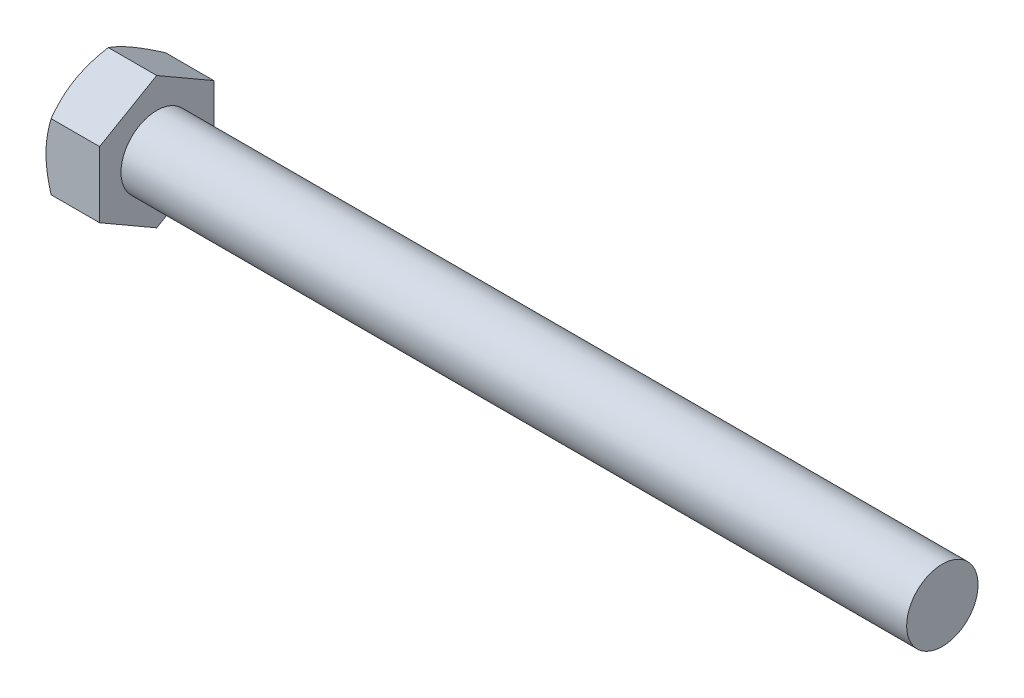
ISO-10303-21;
HEADER;
FILE_DESCRIPTION(('STEP AP214'),'2;1');
FILE_NAME('part.step','',(''),(''),'','','');
FILE_SCHEMA(('AUTOMOTIVE_DESIGN { 1 0 10303 214 1 1 1 1 }'));
ENDSEC;
DATA;
#1=APPLICATION_CONTEXT('core data for automotive mechanical design processes');
#2=APPLICATION_PROTOCOL_DEFINITION('international standard','automotive_design',2000,#1);
#3=PRODUCT_CONTEXT('',#1,'mechanical');
#4=PRODUCT('Part','Part','',(#3));
#5=PRODUCT_RELATED_PRODUCT_CATEGORY('part','',(#4));
#6=PRODUCT_DEFINITION_FORMATION('','',#4);
#7=PRODUCT_DEFINITION_CONTEXT('part definition',#1,'design');
#8=PRODUCT_DEFINITION('design','',#6,#7);
#9=PRODUCT_DEFINITION_SHAPE('','',#8);
#10=(LENGTH_UNIT() NAMED_UNIT(*) SI_UNIT(.MILLI.,.METRE.));
#11=(NAMED_UNIT(*) PLANE_ANGLE_UNIT() SI_UNIT($,.RADIAN.));
#12=(NAMED_UNIT(*) SI_UNIT($,.STERADIAN.) SOLID_ANGLE_UNIT());
#13=UNCERTAINTY_MEASURE_WITH_UNIT(LENGTH_MEASURE(1.E-05),#10,'distance_accuracy_value','');
#14=(GEOMETRIC_REPRESENTATION_CONTEXT(3) GLOBAL_UNCERTAINTY_ASSIGNED_CONTEXT((#13)) GLOBAL_UNIT_ASSIGNED_CONTEXT((#10,
#11,#12)) REPRESENTATION_CONTEXT('',''));
#15=CARTESIAN_POINT('',(0.,0.,0.));
#16=DIRECTION('',(0.,0.,1.));
#17=DIRECTION('',(1.,0.,0.));
#18=AXIS2_PLACEMENT_3D('',#15,#16,#17);
#19=CARTESIAN_POINT('',(0.,0.,0.));
#20=DIRECTION('',(-1.,0.,0.));
#21=DIRECTION('',(0.,0.,1.));
#22=AXIS2_PLACEMENT_3D('',#19,#20,#21);
#23=PLANE('',#22);
#24=CARTESIAN_POINT('',(0.,0.,0.));
#25=DIRECTION('',(-1.,0.,0.));
#26=DIRECTION('',(0.,0.,1.));
#27=AXIS2_PLACEMENT_3D('',#24,#25,#26);
#28=CIRCLE('',#27,8.);
#29=CARTESIAN_POINT('',(0.,0.,8.));
#30=VERTEX_POINT('',#29);
#31=CARTESIAN_POINT('',(0.,6.92820324541336,4.00000002621942));
#32=VERTEX_POINT('',#31);
#33=EDGE_CURVE('E40',#30,#32,#28,.T.);
#34=ORIENTED_EDGE('',*,*,#33,.T.);
#35=CARTESIAN_POINT('',(0.,6.92820324541336,-4.00000002621941));
#36=VERTEX_POINT('',#35);
#37=EDGE_CURVE('E196',#32,#36,#28,.T.);
#38=ORIENTED_EDGE('',*,*,#37,.T.);
#39=CARTESIAN_POINT('',(0.,0.,-8.));
#40=VERTEX_POINT('',#39);
#41=EDGE_CURVE('E201',#36,#40,#28,.T.);
#42=ORIENTED_EDGE('',*,*,#41,.T.);
#43=CARTESIAN_POINT('',(0.,-6.92820324541317,-4.0000000262193));
#44=VERTEX_POINT('',#43);
#45=EDGE_CURVE('E205',#40,#44,#28,.T.);
#46=ORIENTED_EDGE('',*,*,#45,.T.);
#47=CARTESIAN_POINT('',(0.,-6.92820324541317,4.00000002621931));
#48=VERTEX_POINT('',#47);
#49=EDGE_CURVE('E202',#44,#48,#28,.T.);
#50=ORIENTED_EDGE('',*,*,#49,.T.);
#51=EDGE_CURVE('E194',#48,#30,#28,.T.);
#52=ORIENTED_EDGE('',*,*,#51,.T.);
#53=EDGE_LOOP('',(#34,#38,#42,#46,#50,#52));
#54=FACE_BOUND('',#53,.T.);
#55=CARTESIAN_POINT('',(0.,0.,0.));
#56=DIRECTION('',(1.,0.,0.));
#57=DIRECTION('',(0.,0.,-1.));
#58=AXIS2_PLACEMENT_3D('',#55,#56,#57);
#59=CIRCLE('',#58,7.);
#60=CARTESIAN_POINT('',(0.,0.,-7.));
#61=VERTEX_POINT('',#60);
#62=EDGE_CURVE('E233',#61,#61,#59,.T.);
#63=ORIENTED_EDGE('',*,*,#62,.T.);
#64=EDGE_LOOP('',(#63));
#65=FACE_BOUND('',#64,.T.);
#66=ADVANCED_FACE('F32',(#54,#65),#23,.T.);
#67=CARTESIAN_POINT('',(7.5,5.,0.));
#68=DIRECTION('',(-1.,0.,0.));
#69=DIRECTION('',(0.,0.,1.));
#70=AXIS2_PLACEMENT_3D('',#67,#68,#69);
#71=PLANE('',#70);
#72=CARTESIAN_POINT('',(7.5,0.,0.));
#73=DIRECTION('',(-1.,0.,0.));
#74=DIRECTION('',(0.,0.,1.));
#75=AXIS2_PLACEMENT_3D('',#72,#73,#74);
#76=CIRCLE('',#75,5.);
#77=CARTESIAN_POINT('',(7.5,0.,5.));
#78=VERTEX_POINT('',#77);
#79=EDGE_CURVE('E192',#78,#78,#76,.T.);
#80=ORIENTED_EDGE('',*,*,#79,.T.);
#81=EDGE_LOOP('',(#80));
#82=FACE_BOUND('',#81,.T.);
#83=DIRECTION('',(0.,1.,0.));
#84=VECTOR('',#83,1.);
#85=CARTESIAN_POINT('',(7.5,-4.61880217370055,8.));
#86=LINE('',#85,#84);
#87=CARTESIAN_POINT('',(7.5,-4.61880217370055,8.));
#88=VERTEX_POINT('',#87);
#89=CARTESIAN_POINT('',(7.5,4.61880217370081,8.));
#90=VERTEX_POINT('',#89);
#91=EDGE_CURVE('E55',#88,#90,#86,.T.);
#92=ORIENTED_EDGE('',*,*,#91,.F.);
#93=DIRECTION('',(0.,0.50000000163871,0.866025402838329));
#94=VECTOR('',#93,1.);
#95=CARTESIAN_POINT('',(7.5,-9.23760434740123,0.));
#96=LINE('',#95,#94);
#97=CARTESIAN_POINT('',(7.5,-9.23760434740123,0.));
#98=VERTEX_POINT('',#97);
#99=EDGE_CURVE('E129',#98,#88,#96,.T.);
#100=ORIENTED_EDGE('',*,*,#99,.F.);
#101=DIRECTION('',(0.,-0.50000000163871,0.866025402838329));
#102=VECTOR('',#101,1.);
#103=CARTESIAN_POINT('',(7.5,-4.61880217370055,-8.));
#104=LINE('',#103,#102);
#105=CARTESIAN_POINT('',(7.5,-4.61880217370055,-8.));
#106=VERTEX_POINT('',#105);
#107=EDGE_CURVE('E127',#106,#98,#104,.T.);
#108=ORIENTED_EDGE('',*,*,#107,.F.);
#109=DIRECTION('',(0.,-1.,0.));
#110=VECTOR('',#109,1.);
#111=CARTESIAN_POINT('',(7.5,4.61880217370081,-8.));
#112=LINE('',#111,#110);
#113=CARTESIAN_POINT('',(7.5,4.61880217370081,-8.));
#114=VERTEX_POINT('',#113);
#115=EDGE_CURVE('E109',#114,#106,#112,.T.);
#116=ORIENTED_EDGE('',*,*,#115,.F.);
#117=DIRECTION('',(0.,-0.50000000163871,-0.866025402838329));
#118=VECTOR('',#117,1.);
#119=CARTESIAN_POINT('',(7.5,9.23760434740149,0.));
#120=LINE('',#119,#118);
#121=CARTESIAN_POINT('',(7.5,9.23760434740149,0.));
#122=VERTEX_POINT('',#121);
#123=EDGE_CURVE('E118',#122,#114,#120,.T.);
#124=ORIENTED_EDGE('',*,*,#123,.F.);
#125=DIRECTION('',(0.,0.50000000163871,-0.866025402838329));
#126=VECTOR('',#125,1.);
#127=CARTESIAN_POINT('',(7.5,4.61880217370081,8.));
#128=LINE('',#127,#126);
#129=EDGE_CURVE('E122',#90,#122,#128,.T.);
#130=ORIENTED_EDGE('',*,*,#129,.F.);
#131=EDGE_LOOP('',(#92,#100,#108,#116,#124,#130));
#132=FACE_BOUND('',#131,.T.);
#133=ADVANCED_FACE('F124',(#82,#132),#71,.F.);
#134=CARTESIAN_POINT('',(-25.4,0.,0.));
#135=DIRECTION('',(-1.,0.,0.));
#136=DIRECTION('',(0.,0.,1.));
#137=AXIS2_PLACEMENT_3D('',#134,#135,#136);
#138=CYLINDRICAL_SURFACE('',#137,5.);
#139=CARTESIAN_POINT('',(117.5,0.,0.));
#140=DIRECTION('',(-1.,0.,0.));
#141=DIRECTION('',(0.,0.,1.));
#142=AXIS2_PLACEMENT_3D('',#139,#140,#141);
#143=CIRCLE('',#142,5.);
#144=CARTESIAN_POINT('',(117.5,0.,5.));
#145=VERTEX_POINT('',#144);
#146=EDGE_CURVE('E11',#145,#145,#143,.T.);
#147=ORIENTED_EDGE('',*,*,#146,.T.);
#148=EDGE_LOOP('',(#147));
#149=FACE_BOUND('',#148,.T.);
#150=ORIENTED_EDGE('',*,*,#79,.F.);
#151=EDGE_LOOP('',(#150));
#152=FACE_BOUND('',#151,.T.);
#153=ADVANCED_FACE('F34',(#149,#152),#138,.T.);
#154=CARTESIAN_POINT('',(117.5,5.,0.));
#155=DIRECTION('',(1.,0.,0.));
#156=DIRECTION('',(0.,0.,-1.));
#157=AXIS2_PLACEMENT_3D('',#154,#155,#156);
#158=PLANE('',#157);
#159=ORIENTED_EDGE('',*,*,#146,.F.);
#160=EDGE_LOOP('',(#159));
#161=FACE_BOUND('',#160,.T.);
#162=ADVANCED_FACE('F175',(#161),#158,.T.);
#163=CARTESIAN_POINT('',(7.5,-4.61880217370055,8.));
#164=DIRECTION('',(0.,0.,1.));
#165=DIRECTION('',(0.,-1.,0.));
#166=AXIS2_PLACEMENT_3D('',#163,#164,#165);
#167=PLANE('',#166);
#168=DIRECTION('',(-1.,0.,0.));
#169=VECTOR('',#168,1.);
#170=CARTESIAN_POINT('',(7.5,-4.61880217370055,8.));
#171=LINE('',#170,#169);
#172=CARTESIAN_POINT('',(0.714531185642812,-4.61880217370055,8.));
#173=VERTEX_POINT('',#172);
#174=EDGE_CURVE('E136',#88,#173,#171,.T.);
#175=ORIENTED_EDGE('',*,*,#174,.F.);
#176=ORIENTED_EDGE('',*,*,#91,.T.);
#177=DIRECTION('',(-1.,0.,0.));
#178=VECTOR('',#177,1.);
#179=CARTESIAN_POINT('',(7.5,4.61880217370081,8.));
#180=LINE('',#179,#178);
#181=CARTESIAN_POINT('',(0.71453118564289,4.61880217370081,8.));
#182=VERTEX_POINT('',#181);
#183=EDGE_CURVE('E135',#90,#182,#180,.T.);
#184=ORIENTED_EDGE('',*,*,#183,.T.);
#185=CARTESIAN_POINT('',(3.82822414101115,-12.2497656982226,7.99999999999999));
#186=CARTESIAN_POINT('',(3.65848286879736,-11.8985202843054,7.99999999999999));
#187=CARTESIAN_POINT('',(3.49042895769105,-11.546444421205,7.99999999999999));
#188=CARTESIAN_POINT('',(3.15866007606797,-10.8401827517385,7.99999999999999));
#189=CARTESIAN_POINT('',(2.99494585678538,-10.4859965928938,7.99999999999999));
#190=CARTESIAN_POINT('',(2.67195812645104,-9.77315201266954,7.99999999999999));
#191=CARTESIAN_POINT('',(2.51271538890513,-9.41447959727725,7.99999999999999));
#192=CARTESIAN_POINT('',(2.20106973608564,-8.6941868708221,7.99999999999999));
#193=CARTESIAN_POINT('',(2.04866646428538,-8.33256671458254,7.99999999999999));
#194=CARTESIAN_POINT('',(1.75070912610617,-7.60131370455928,7.99999999999999));
#195=CARTESIAN_POINT('',(1.60526212024156,-7.23163698414151,7.99999999999999));
#196=CARTESIAN_POINT('',(1.32575932370829,-6.487924160903,7.99999999999999));
#197=CARTESIAN_POINT('',(1.19170480039105,-6.11388757832081,8.));
#198=CARTESIAN_POINT('',(0.938589488850541,-5.36162356561332,8.));
#199=CARTESIAN_POINT('',(0.819496824182946,-4.98340697934676,8.));
#200=CARTESIAN_POINT('',(0.600170997908561,-4.22161055060636,8.));
#201=CARTESIAN_POINT('',(0.499931872278401,-3.83803244555409,8.));
#202=CARTESIAN_POINT('',(0.323186748232362,-3.06518689861532,8.));
#203=CARTESIAN_POINT('',(0.2466870679096,-2.67591797096946,8.));
#204=CARTESIAN_POINT('',(0.153572527253884,-2.08858914234208,8.));
#205=CARTESIAN_POINT('',(0.126138156302342,-1.89221786409481,8.));
#206=CARTESIAN_POINT('',(0.0790208692877555,-1.49855462524936,8.));
#207=CARTESIAN_POINT('',(0.0593371858268334,-1.30126275775715,8.));
#208=CARTESIAN_POINT('',(0.0282509892994569,-0.907276578206895,8.));
#209=CARTESIAN_POINT('',(0.0167970522476314,-0.710586340026116,8.));
#210=CARTESIAN_POINT('',(0.00223090595896796,-0.31689732495212,8.));
#211=CARTESIAN_POINT('',(-0.000881411608064002,-0.119898552098998,8.));
#212=CARTESIAN_POINT('',(0.00130984053934218,0.273997538414058,8.));
#213=CARTESIAN_POINT('',(0.00661104833168882,0.470894869030626,8.));
#214=CARTESIAN_POINT('',(0.0254975236721216,0.864294473957554,8.));
#215=CARTESIAN_POINT('',(0.039083204923604,1.0607967280472,8.));
#216=CARTESIAN_POINT('',(0.0817669665798397,1.53705699197599,8.));
#217=CARTESIAN_POINT('',(0.115015825491784,1.81644908989183,8.));
#218=CARTESIAN_POINT('',(0.196415724202097,2.37309234461893,8.));
#219=CARTESIAN_POINT('',(0.244570831513707,2.65034289586915,8.));
#220=CARTESIAN_POINT('',(0.354075319593895,3.20247432368565,8.));
#221=CARTESIAN_POINT('',(0.415437175577185,3.47735270235345,8.));
#222=CARTESIAN_POINT('',(0.549482936842532,4.02428135859502,8.));
#223=CARTESIAN_POINT('',(0.622165775535714,4.29633190001607,8.));
#224=CARTESIAN_POINT('',(0.779014575856635,4.8443054564892,8.));
#225=CARTESIAN_POINT('',(0.863418343438945,5.12015993256326,8.));
#226=CARTESIAN_POINT('',(1.04056550506418,5.66895309638315,8.));
#227=CARTESIAN_POINT('',(1.13330314694985,5.94189365197879,8.00000000000001));
#228=CARTESIAN_POINT('',(1.32520246628364,6.48376376437684,8.00000000000001));
#229=CARTESIAN_POINT('',(1.42432504691621,6.75270725047684,8.00000000000001));
#230=CARTESIAN_POINT('',(1.62838816906517,7.28850759026013,8.00000000000001));
#231=CARTESIAN_POINT('',(1.73333106198455,7.55536355016898,8.00000000000001));
#232=CARTESIAN_POINT('',(1.84060835471515,7.82125004980533,8.00000000000001));
#233=B_SPLINE_CURVE_WITH_KNOTS('',3,(#185,#186,#187,#188,#189,#190,#191,#192,#193,#194,#195,
#196,#197,#198,#199,#200,#201,#202,#203,#204,#205,#206,#207,#208,#209,#210,#211,#212,#213,#214,
#215,#216,#217,#218,#219,#220,#221,#222,#223,#224,#225,#226,#227,#228,#229,#230,#231,#232),
.UNSPECIFIED.,.F.,.F.,(4,2,2,2,2,2,2,2,2,2,2,2,2,2,2,2,2,2,2,2,2,2,2,4),(0.,1.17034426617222,
2.34088982216394,3.51813389970139,4.6953165385788,5.88695165739568,7.0787191660535,
8.26790291341459,9.45670984600031,10.6458329007115,11.2405391306507,11.8351864637341,
12.4260850123376,13.0169758870758,13.6077009108412,14.1984554361754,15.0420758899104,
15.8859267481502,16.7305782416716,17.5751502057393,18.4404245595524,19.3051062097702,
20.1649208601746,21.0250854420212),.UNSPECIFIED.);
#234=EDGE_CURVE('E177',#30,#182,#233,.T.);
#235=ORIENTED_EDGE('',*,*,#234,.F.);
#236=EDGE_CURVE('E184',#173,#30,#233,.T.);
#237=ORIENTED_EDGE('',*,*,#236,.F.);
#238=EDGE_LOOP('',(#175,#176,#184,#235,#237));
#239=FACE_BOUND('',#238,.T.);
#240=ADVANCED_FACE('F171',(#239),#167,.T.);
#241=CARTESIAN_POINT('',(7.5,-9.23760434740123,0.));
#242=DIRECTION('',(0.,-0.866025402838329,0.50000000163871));
#243=DIRECTION('',(0.,-0.50000000163871,-0.866025402838329));
#244=AXIS2_PLACEMENT_3D('',#241,#242,#243);
#245=PLANE('',#244);
#246=DIRECTION('',(-1.,0.,0.));
#247=VECTOR('',#246,1.);
#248=CARTESIAN_POINT('',(7.5,-9.23760434740123,0.));
#249=LINE('',#248,#247);
#250=CARTESIAN_POINT('',(0.71453120312235,-9.23760434740123,0.));
#251=VERTEX_POINT('',#250);
#252=EDGE_CURVE('E140',#98,#251,#249,.T.);
#253=ORIENTED_EDGE('',*,*,#252,.F.);
#254=ORIENTED_EDGE('',*,*,#99,.T.);
#255=ORIENTED_EDGE('',*,*,#174,.T.);
#256=CARTESIAN_POINT('',(0.714597871039292,-9.23771981745557,-0.000199999999996303));
#257=CARTESIAN_POINT('',(0.655990736923305,-9.13619347400029,0.175648784402799));
#258=CARTESIAN_POINT('',(0.600043423495619,-9.03428860437913,0.352153195354028));
#259=CARTESIAN_POINT('',(0.494201026626136,-8.82965126370277,0.706595464982381));
#260=CARTESIAN_POINT('',(0.44430855561336,-8.72691845566661,0.884533907327673));
#261=CARTESIAN_POINT('',(0.304692817146083,-8.41707515629909,1.42119824187182));
#262=CARTESIAN_POINT('',(0.225281190112561,-8.20874157525887,1.78204258757939));
#263=CARTESIAN_POINT('',(0.132161664305385,-7.89697439751329,2.32203917720736));
#264=CARTESIAN_POINT('',(0.105634598683679,-7.79447219608365,2.49957819719533));
#265=CARTESIAN_POINT('',(0.0611531918321801,-7.58900424766936,2.85545912162067));
#266=CARTESIAN_POINT('',(0.0431980931629698,-7.4860385424529,3.0338009537134));
#267=CARTESIAN_POINT('',(0.016315664530113,-7.27992984087247,3.39079169517274));
#268=CARTESIAN_POINT('',(0.00737808929916559,-7.17678717937825,3.56944002452793));
#269=CARTESIAN_POINT('',(-0.00127768080583133,-6.97040657400776,3.92690171716438));
#270=CARTESIAN_POINT('',(-0.000996160506702856,-6.86716863317371,4.10571507517635));
#271=CARTESIAN_POINT('',(0.00814503983248542,-6.67416141624368,4.44001337966578));
#272=CARTESIAN_POINT('',(0.0158896186877174,-6.58437852030024,4.59552191641093));
#273=CARTESIAN_POINT('',(0.0382011486356484,-6.40502300933047,4.90617477267052));
#274=CARTESIAN_POINT('',(0.0527685596255884,-6.31545040888835,5.06131906692438));
#275=CARTESIAN_POINT('',(0.106360703064378,-6.04707937863194,5.52615132457682));
#276=CARTESIAN_POINT('',(0.155268653484357,-5.86875598870038,5.83501649476649));
#277=CARTESIAN_POINT('',(0.27753941347751,-5.51021757899271,6.45602323413139));
#278=CARTESIAN_POINT('',(0.351420529762537,-5.33004831822991,6.768085546371));
#279=CARTESIAN_POINT('',(0.519100148881198,-4.97239660419655,7.38755648378386));
#280=CARTESIAN_POINT('',(0.612859267577916,-4.79490957082323,7.69497304192775));
#281=CARTESIAN_POINT('',(0.714597853559099,-4.61868670364621,8.0002));
#282=B_SPLINE_CURVE_WITH_KNOTS('',3,(#256,#257,#258,#259,#260,#261,#262,#263,#264,#265,#266,
#267,#268,#269,#270,#271,#272,#273,#274,#275,#276,#277,#278,#279,#280,#281),.UNSPECIFIED.,.F.,
.F.,(4,2,2,2,2,2,2,2,2,2,2,2,4),(0.,0.633973546459013,1.26821966262013,2.53934713534089,
3.15934345345195,3.77928497706708,4.39852135771862,5.01773860688775,5.55680241439714,
6.09590256306806,7.17487079008232,8.27776851436756,9.37850116222513),.UNSPECIFIED.);
#283=EDGE_CURVE('E186',#48,#173,#282,.T.);
#284=ORIENTED_EDGE('',*,*,#283,.F.);
#285=EDGE_CURVE('E185',#251,#48,#282,.T.);
#286=ORIENTED_EDGE('',*,*,#285,.F.);
#287=EDGE_LOOP('',(#253,#254,#255,#284,#286));
#288=FACE_BOUND('',#287,.T.);
#289=ADVANCED_FACE('F174',(#288),#245,.T.);
#290=CARTESIAN_POINT('',(7.5,-4.61880217370055,-8.));
#291=DIRECTION('',(0.,-0.866025402838329,-0.50000000163871));
#292=DIRECTION('',(0.,0.50000000163871,-0.866025402838329));
#293=AXIS2_PLACEMENT_3D('',#290,#291,#292);
#294=PLANE('',#293);
#295=DIRECTION('',(-1.,0.,0.));
#296=VECTOR('',#295,1.);
#297=CARTESIAN_POINT('',(7.5,-4.61880217370055,-8.));
#298=LINE('',#297,#296);
#299=CARTESIAN_POINT('',(0.714531185642812,-4.61880217370055,-8.));
#300=VERTEX_POINT('',#299);
#301=EDGE_CURVE('E115',#106,#300,#298,.T.);
#302=ORIENTED_EDGE('',*,*,#301,.F.);
#303=ORIENTED_EDGE('',*,*,#107,.T.);
#304=ORIENTED_EDGE('',*,*,#252,.T.);
#305=CARTESIAN_POINT('',(0.714597853559099,-4.61868670364621,-8.0002));
#306=CARTESIAN_POINT('',(0.655990720160654,-4.72021304685638,-7.82435121602175));
#307=CARTESIAN_POINT('',(0.600043407468509,-4.82211791623125,-7.64784680549711));
#308=CARTESIAN_POINT('',(0.4942010121035,-5.02675525640989,-7.29340453673082));
#309=CARTESIAN_POINT('',(0.444308541859669,-5.12948806419463,-7.115466094821));
#310=CARTESIAN_POINT('',(0.304692805754265,-5.43933136278073,-6.57880176163031));
#311=CARTESIAN_POINT('',(0.225281180357152,-5.64766494327923,-6.21795741686103));
#312=CARTESIAN_POINT('',(0.132161657001096,-5.95943212018714,-5.67796082868395));
#313=CARTESIAN_POINT('',(0.105634592184731,-6.06193432134328,-5.5004218091697));
#314=CARTESIAN_POINT('',(0.0611531869346923,-6.2674022691947,-5.14454088571928));
#315=CARTESIAN_POINT('',(0.0431980890616107,-6.37036797412179,-4.96619905412774));
#316=CARTESIAN_POINT('',(0.0163156619914865,-6.57647667510862,-4.60920831369654));
#317=CARTESIAN_POINT('',(0.00737808752735852,-6.67961933629864,-4.43055998486825));
#318=CARTESIAN_POINT('',(-0.00127768109245696,-6.88599994104392,-4.0730982933147));
#319=CARTESIAN_POINT('',(-0.000996160074949297,-6.98923788155696,-3.89428493585874));
#320=CARTESIAN_POINT('',(0.00814504157393753,-7.18224509847458,-3.5599866313908));
#321=CARTESIAN_POINT('',(0.0158896210753607,-7.27202799472784,-3.40447809410903));
#322=CARTESIAN_POINT('',(0.0382011523455288,-7.45138350630451,-3.09382523679824));
#323=CARTESIAN_POINT('',(0.0527685640115254,-7.54095610704372,-2.93868094202981));
#324=CARTESIAN_POINT('',(0.106360709504681,-7.80932713817435,-2.47384868286318));
#325=CARTESIAN_POINT('',(0.15526866132817,-7.98765052866424,-2.16498351170646));
#326=CARTESIAN_POINT('',(0.277539424141199,-8.34618893947705,-1.5439767704274));
#327=CARTESIAN_POINT('',(0.351420541844038,-8.52635820078562,-1.23191445724247));
#328=CARTESIAN_POINT('',(0.519100163726599,-8.88400991587941,-0.612443517992902));
#329=CARTESIAN_POINT('',(0.612859283768846,-9.06149694976751,-0.305026958957405));
#330=CARTESIAN_POINT('',(0.714597871039292,-9.23771981745557,0.000200000000002917));
#331=B_SPLINE_CURVE_WITH_KNOTS('',3,(#305,#306,#307,#308,#309,#310,#311,#312,#313,#314,#315,
#316,#317,#318,#319,#320,#321,#322,#323,#324,#325,#326,#327,#328,#329,#330),.UNSPECIFIED.,.F.,
.F.,(4,2,2,2,2,2,2,2,2,2,2,2,4),(0.,0.633973544448733,1.26821965859846,2.539347127198,
3.1593434433715,3.77928496504979,4.39852134377931,5.01773859102754,5.55680240047657,
6.09590255108796,7.17487078199376,8.27776851034647,9.37850116222567),.UNSPECIFIED.);
#332=EDGE_CURVE('E215',#44,#251,#331,.T.);
#333=ORIENTED_EDGE('',*,*,#332,.F.);
#334=EDGE_CURVE('E220',#300,#44,#331,.T.);
#335=ORIENTED_EDGE('',*,*,#334,.F.);
#336=EDGE_LOOP('',(#302,#303,#304,#333,#335));
#337=FACE_BOUND('',#336,.T.);
#338=ADVANCED_FACE('F292',(#337),#294,.T.);
#339=CARTESIAN_POINT('',(7.5,4.61880217370081,-8.));
#340=DIRECTION('',(0.,0.,-1.));
#341=DIRECTION('',(-1.,0.,0.));
#342=AXIS2_PLACEMENT_3D('',#339,#340,#341);
#343=PLANE('',#342);
#344=DIRECTION('',(-1.,0.,0.));
#345=VECTOR('',#344,1.);
#346=CARTESIAN_POINT('',(7.5,4.61880217370081,-8.));
#347=LINE('',#346,#345);
#348=CARTESIAN_POINT('',(0.714531185642887,4.61880217370081,-8.));
#349=VERTEX_POINT('',#348);
#350=EDGE_CURVE('E104',#114,#349,#347,.T.);
#351=ORIENTED_EDGE('',*,*,#350,.F.);
#352=ORIENTED_EDGE('',*,*,#115,.T.);
#353=ORIENTED_EDGE('',*,*,#301,.T.);
#354=CARTESIAN_POINT('',(3.82822414101115,-12.2497656982226,-8.));
#355=CARTESIAN_POINT('',(3.65848286879736,-11.8985202843054,-8.));
#356=CARTESIAN_POINT('',(3.49042895769105,-11.546444421205,-8.));
#357=CARTESIAN_POINT('',(3.15866007606797,-10.8401827517385,-8.));
#358=CARTESIAN_POINT('',(2.99494585678538,-10.4859965928938,-8.));
#359=CARTESIAN_POINT('',(2.67195812645104,-9.77315201266954,-8.));
#360=CARTESIAN_POINT('',(2.51271538890513,-9.41447959727725,-8.));
#361=CARTESIAN_POINT('',(2.20106973608564,-8.6941868708221,-8.));
#362=CARTESIAN_POINT('',(2.04866646428538,-8.33256671458254,-8.));
#363=CARTESIAN_POINT('',(1.75070912610617,-7.60131370455928,-8.));
#364=CARTESIAN_POINT('',(1.60526212024156,-7.23163698414151,-8.));
#365=CARTESIAN_POINT('',(1.32575932370829,-6.487924160903,-8.));
#366=CARTESIAN_POINT('',(1.19170480039105,-6.11388757832081,-8.));
#367=CARTESIAN_POINT('',(0.938589488850541,-5.36162356561332,-8.));
#368=CARTESIAN_POINT('',(0.819496824182945,-4.98340697934676,-8.));
#369=CARTESIAN_POINT('',(0.600170997908561,-4.22161055060635,-8.));
#370=CARTESIAN_POINT('',(0.499931872278401,-3.83803244555409,-8.));
#371=CARTESIAN_POINT('',(0.323186748232361,-3.06518689861531,-8.));
#372=CARTESIAN_POINT('',(0.246687067909597,-2.67591797096946,-8.));
#373=CARTESIAN_POINT('',(0.153572527253883,-2.08858914234208,-8.));
#374=CARTESIAN_POINT('',(0.126138156302341,-1.8922178640948,-8.));
#375=CARTESIAN_POINT('',(0.0790208692877543,-1.49855462524935,-8.));
#376=CARTESIAN_POINT('',(0.059337185826832,-1.30126275775715,-8.));
#377=CARTESIAN_POINT('',(0.0282509892994553,-0.907276578206894,-8.));
#378=CARTESIAN_POINT('',(0.0167970522476297,-0.710586340026115,-8.));
#379=CARTESIAN_POINT('',(0.0022309059589661,-0.316897324952118,-8.));
#380=CARTESIAN_POINT('',(-0.000881411608065942,-0.119898552098996,-8.));
#381=CARTESIAN_POINT('',(0.00130984053934005,0.273997538414059,-8.));
#382=CARTESIAN_POINT('',(0.00661104833168658,0.470894869030628,-8.));
#383=CARTESIAN_POINT('',(0.0254975236721192,0.864294473957555,-8.));
#384=CARTESIAN_POINT('',(0.0390832049236015,1.0607967280472,-8.));
#385=CARTESIAN_POINT('',(0.081766966579837,1.53705699197599,-8.));
#386=CARTESIAN_POINT('',(0.115015825491781,1.81644908989183,-8.));
#387=CARTESIAN_POINT('',(0.196415724202094,2.37309234461893,-8.));
#388=CARTESIAN_POINT('',(0.244570831513704,2.65034289586914,-8.));
#389=CARTESIAN_POINT('',(0.354075319593891,3.20247432368565,-8.));
#390=CARTESIAN_POINT('',(0.415437175577181,3.47735270235344,-8.));
#391=CARTESIAN_POINT('',(0.549482936842527,4.02428135859502,-8.));
#392=CARTESIAN_POINT('',(0.62216577553571,4.29633190001607,-8.));
#393=CARTESIAN_POINT('',(0.779014575856629,4.84430545648919,-8.));
#394=CARTESIAN_POINT('',(0.86341834343894,5.12015993256325,-8.));
#395=CARTESIAN_POINT('',(1.04056550506417,5.66895309638315,-8.));
#396=CARTESIAN_POINT('',(1.13330314694985,5.94189365197878,-8.));
#397=CARTESIAN_POINT('',(1.32520246628364,6.48376376437684,-8.));
#398=CARTESIAN_POINT('',(1.4243250469162,6.75270725047683,-8.));
#399=CARTESIAN_POINT('',(1.62838816906516,7.28850759026011,-8.));
#400=CARTESIAN_POINT('',(1.73333106198454,7.55536355016896,-8.));
#401=CARTESIAN_POINT('',(1.84060835471514,7.82125004980532,-8.));
#402=B_SPLINE_CURVE_WITH_KNOTS('',3,(#354,#355,#356,#357,#358,#359,#360,#361,#362,#363,#364,
#365,#366,#367,#368,#369,#370,#371,#372,#373,#374,#375,#376,#377,#378,#379,#380,#381,#382,#383,
#384,#385,#386,#387,#388,#389,#390,#391,#392,#393,#394,#395,#396,#397,#398,#399,#400,#401),
.UNSPECIFIED.,.F.,.F.,(4,2,2,2,2,2,2,2,2,2,2,2,2,2,2,2,2,2,2,2,2,2,2,4),(0.,1.17034426617222,
2.34088982216394,3.51813389970139,4.6953165385788,5.88695165739568,7.07871916605351,
8.2679029134146,9.45670984600032,10.6458329007116,11.2405391306507,11.8351864637341,
12.4260850123376,13.0169758870758,13.6077009108412,14.1984554361754,15.0420758899104,
15.8859267481502,16.7305782416716,17.5751502057393,18.4404245595524,19.3051062097702,
20.1649208601746,21.0250854420212),.UNSPECIFIED.);
#403=EDGE_CURVE('E216',#40,#300,#402,.F.);
#404=ORIENTED_EDGE('',*,*,#403,.F.);
#405=EDGE_CURVE('E112',#349,#40,#402,.F.);
#406=ORIENTED_EDGE('',*,*,#405,.F.);
#407=EDGE_LOOP('',(#351,#352,#353,#404,#406));
#408=FACE_BOUND('',#407,.T.);
#409=ADVANCED_FACE('F106',(#408),#343,.T.);
#410=CARTESIAN_POINT('',(7.5,9.23760434740149,0.));
#411=DIRECTION('',(0.,0.866025402838329,-0.50000000163871));
#412=DIRECTION('',(0.,0.50000000163871,0.866025402838329));
#413=AXIS2_PLACEMENT_3D('',#410,#411,#412);
#414=PLANE('',#413);
#415=DIRECTION('',(-1.,0.,0.));
#416=VECTOR('',#415,1.);
#417=CARTESIAN_POINT('',(7.5,9.23760434740149,0.));
#418=LINE('',#417,#416);
#419=CARTESIAN_POINT('',(0.714531203122499,9.23760434740149,0.));
#420=VERTEX_POINT('',#419);
#421=EDGE_CURVE('E47',#122,#420,#418,.T.);
#422=ORIENTED_EDGE('',*,*,#421,.F.);
#423=ORIENTED_EDGE('',*,*,#123,.T.);
#424=ORIENTED_EDGE('',*,*,#350,.T.);
#425=CARTESIAN_POINT('',(0.71459787103944,9.23771981745583,0.000200000000005052));
#426=CARTESIAN_POINT('',(0.655990736923452,9.13619347400054,-0.175648784402795));
#427=CARTESIAN_POINT('',(0.600043423495764,9.03428860437938,-0.35215319535403));
#428=CARTESIAN_POINT('',(0.494201026626277,8.82965126370302,-0.706595464982392));
#429=CARTESIAN_POINT('',(0.4443085556135,8.72691845566685,-0.884533907327689));
#430=CARTESIAN_POINT('',(0.304692817146219,8.41707515629932,-1.42119824187185));
#431=CARTESIAN_POINT('',(0.225281190112695,8.2087415752591,-1.78204258757943));
#432=CARTESIAN_POINT('',(0.132161664305517,7.89697439751352,-2.32203917720742));
#433=CARTESIAN_POINT('',(0.10563459868381,7.79447219608387,-2.49957819719539));
#434=CARTESIAN_POINT('',(0.061153191832309,7.58900424766957,-2.85545912162074));
#435=CARTESIAN_POINT('',(0.0431980931630979,7.48603854245311,-3.03380095371347));
#436=CARTESIAN_POINT('',(0.0163156645302404,7.27992984087268,-3.39079169517283));
#437=CARTESIAN_POINT('',(0.00737808929929302,7.17678717937846,-3.56944002452802));
#438=CARTESIAN_POINT('',(-0.00127768080570461,6.97040657400795,-3.92690171716448));
#439=CARTESIAN_POINT('',(-0.000996160506576887,6.8671686331739,-4.10571507517645));
#440=CARTESIAN_POINT('',(0.00814503983261155,6.67416141624387,-4.44001337966588));
#441=CARTESIAN_POINT('',(0.0158896186878438,6.58437852030044,-4.59552191641103));
#442=CARTESIAN_POINT('',(0.0382011486357739,6.40502300933068,-4.90617477267061));
#443=CARTESIAN_POINT('',(0.0527685596257126,6.31545040888856,-5.06131906692447));
#444=CARTESIAN_POINT('',(0.106360703064497,6.04707937863215,-5.52615132457689));
#445=CARTESIAN_POINT('',(0.155268653484472,5.8687559887006,-5.83501649476656));
#446=CARTESIAN_POINT('',(0.277539413477616,5.51021757899294,-6.45602323413144));
#447=CARTESIAN_POINT('',(0.351420529762636,5.33004831823015,-6.76808554637104));
#448=CARTESIAN_POINT('',(0.519100148881285,4.97239660419679,-7.38755648378388));
#449=CARTESIAN_POINT('',(0.612859267577996,4.79490957082348,-7.69497304192776));
#450=CARTESIAN_POINT('',(0.714597853559173,4.61868670364646,-8.0002));
#451=B_SPLINE_CURVE_WITH_KNOTS('',3,(#425,#426,#427,#428,#429,#430,#431,#432,#433,#434,#435,
#436,#437,#438,#439,#440,#441,#442,#443,#444,#445,#446,#447,#448,#449,#450),.UNSPECIFIED.,.F.,
.F.,(4,2,2,2,2,2,2,2,2,2,2,2,4),(0.,0.633973546459031,1.26821966262017,2.53934713534096,
3.15934345345203,3.77928497706718,4.39852135771874,5.01773860688789,5.55680241439726,
6.09590256306816,7.17487079008239,8.27776851436759,9.37850116222513),.UNSPECIFIED.);
#452=EDGE_CURVE('E154',#36,#349,#451,.T.);
#453=ORIENTED_EDGE('',*,*,#452,.F.);
#454=EDGE_CURVE('E379',#420,#36,#451,.T.);
#455=ORIENTED_EDGE('',*,*,#454,.F.);
#456=EDGE_LOOP('',(#422,#423,#424,#453,#455));
#457=FACE_BOUND('',#456,.T.);
#458=ADVANCED_FACE('F119',(#457),#414,.T.);
#459=CARTESIAN_POINT('',(7.5,4.61880217370081,8.));
#460=DIRECTION('',(0.,0.866025402838329,0.50000000163871));
#461=DIRECTION('',(0.,-0.50000000163871,0.866025402838329));
#462=AXIS2_PLACEMENT_3D('',#459,#460,#461);
#463=PLANE('',#462);
#464=ORIENTED_EDGE('',*,*,#183,.F.);
#465=ORIENTED_EDGE('',*,*,#129,.T.);
#466=ORIENTED_EDGE('',*,*,#421,.T.);
#467=CARTESIAN_POINT('',(0.714597853559177,4.61868670364646,8.0002));
#468=CARTESIAN_POINT('',(0.655990720160734,4.72021304685664,7.82435121602175));
#469=CARTESIAN_POINT('',(0.600043407468589,4.82211791623151,7.64784680549711));
#470=CARTESIAN_POINT('',(0.494201012103584,5.02675525641015,7.29340453673081));
#471=CARTESIAN_POINT('',(0.444308541859755,5.1294880641949,7.115466094821));
#472=CARTESIAN_POINT('',(0.304692805754357,5.439331362781,6.5788017616303));
#473=CARTESIAN_POINT('',(0.225281180357248,5.6476649432795,6.217957416861));
#474=CARTESIAN_POINT('',(0.1321616570012,5.95943212018742,5.67796082868391));
#475=CARTESIAN_POINT('',(0.105634592184838,6.06193432134356,5.50042180916966));
#476=CARTESIAN_POINT('',(0.0611531869348043,6.26740226919499,5.14454088571923));
#477=CARTESIAN_POINT('',(0.0431980890617248,6.37036797412208,4.9661990541277));
#478=CARTESIAN_POINT('',(0.0163156619916063,6.57647667510891,4.60920831369649));
#479=CARTESIAN_POINT('',(0.00737808752748196,6.67961933629893,4.4305599848682));
#480=CARTESIAN_POINT('',(-0.00127768109232752,6.88599994104421,4.07309829331464));
#481=CARTESIAN_POINT('',(-0.000996160074817488,6.98923788155725,3.89428493585868));
#482=CARTESIAN_POINT('',(0.00814504157407505,7.18224509847488,3.55998663139074));
#483=CARTESIAN_POINT('',(0.0158896210755011,7.27202799472813,3.40447809410897));
#484=CARTESIAN_POINT('',(0.0382011523456733,7.4513835063048,3.09382523679819));
#485=CARTESIAN_POINT('',(0.0527685640116711,7.54095610704401,2.93868094202976));
#486=CARTESIAN_POINT('',(0.10636070950483,7.80932713817464,2.47384868286314));
#487=CARTESIAN_POINT('',(0.155268661328322,7.98765052866452,2.16498351170642));
#488=CARTESIAN_POINT('',(0.277539424141353,8.34618893947732,1.54397677042738));
#489=CARTESIAN_POINT('',(0.351420541844191,8.5263582007859,1.23191445724245));
#490=CARTESIAN_POINT('',(0.519100163726751,8.88400991587968,0.612443517992897));
#491=CARTESIAN_POINT('',(0.612859283768996,9.06149694976777,0.305026958957407));
#492=CARTESIAN_POINT('',(0.714597871039441,9.23771981745583,-0.000199999999995066));
#493=B_SPLINE_CURVE_WITH_KNOTS('',3,(#467,#468,#469,#470,#471,#472,#473,#474,#475,#476,#477,
#478,#479,#480,#481,#482,#483,#484,#485,#486,#487,#488,#489,#490,#491,#492),.UNSPECIFIED.,.F.,
.F.,(4,2,2,2,2,2,2,2,2,2,2,2,4),(0.,0.633973544448742,1.26821965859848,2.53934712719804,
3.15934344337154,3.77928496504985,4.39852134377938,5.01773859102761,5.55680240047663,
6.09590255108801,7.1748707819938,8.27776851034649,9.37850116222566),.UNSPECIFIED.);
#494=EDGE_CURVE('E139',#32,#420,#493,.T.);
#495=ORIENTED_EDGE('',*,*,#494,.F.);
#496=EDGE_CURVE('E153',#182,#32,#493,.T.);
#497=ORIENTED_EDGE('',*,*,#496,.F.);
#498=EDGE_LOOP('',(#464,#465,#466,#495,#497));
#499=FACE_BOUND('',#498,.T.);
#500=ADVANCED_FACE('F164',(#499),#463,.T.);
#501=CARTESIAN_POINT('',(0.,0.,0.));
#502=DIRECTION('',(1.,0.,0.));
#503=DIRECTION('',(0.,0.,-1.));
#504=AXIS2_PLACEMENT_3D('',#501,#502,#503);
#505=CONICAL_SURFACE('',#504,8.,1.0471975511966);
#506=ORIENTED_EDGE('',*,*,#51,.F.);
#507=ORIENTED_EDGE('',*,*,#283,.T.);
#508=ORIENTED_EDGE('',*,*,#236,.T.);
#509=EDGE_LOOP('',(#506,#507,#508));
#510=FACE_BOUND('',#509,.T.);
#511=ADVANCED_FACE('F168',(#510),#505,.T.);
#512=ORIENTED_EDGE('',*,*,#49,.F.);
#513=ORIENTED_EDGE('',*,*,#332,.T.);
#514=ORIENTED_EDGE('',*,*,#285,.T.);
#515=EDGE_LOOP('',(#512,#513,#514));
#516=FACE_BOUND('',#515,.T.);
#517=ADVANCED_FACE('F225',(#516),#505,.T.);
#518=ORIENTED_EDGE('',*,*,#403,.T.);
#519=ORIENTED_EDGE('',*,*,#334,.T.);
#520=ORIENTED_EDGE('',*,*,#45,.F.);
#521=EDGE_LOOP('',(#518,#519,#520));
#522=FACE_BOUND('',#521,.T.);
#523=ADVANCED_FACE('F160',(#522),#505,.T.);
#524=ORIENTED_EDGE('',*,*,#452,.T.);
#525=ORIENTED_EDGE('',*,*,#405,.T.);
#526=ORIENTED_EDGE('',*,*,#41,.F.);
#527=EDGE_LOOP('',(#524,#525,#526));
#528=FACE_BOUND('',#527,.T.);
#529=ADVANCED_FACE('F214',(#528),#505,.T.);
#530=ORIENTED_EDGE('',*,*,#33,.F.);
#531=ORIENTED_EDGE('',*,*,#234,.T.);
#532=ORIENTED_EDGE('',*,*,#496,.T.);
#533=EDGE_LOOP('',(#530,#531,#532));
#534=FACE_BOUND('',#533,.T.);
#535=ADVANCED_FACE('F251',(#534),#505,.T.);
#536=ORIENTED_EDGE('',*,*,#494,.T.);
#537=ORIENTED_EDGE('',*,*,#454,.T.);
#538=ORIENTED_EDGE('',*,*,#37,.F.);
#539=EDGE_LOOP('',(#536,#537,#538));
#540=FACE_BOUND('',#539,.T.);
#541=ADVANCED_FACE('F242',(#540),#505,.T.);
#542=CARTESIAN_POINT('',(0.9375,0.,0.));
#543=DIRECTION('',(-1.,0.,0.));
#544=DIRECTION('',(0.,0.,1.));
#545=AXIS2_PLACEMENT_3D('',#542,#543,#544);
#546=CYLINDRICAL_SURFACE('',#545,7.);
#547=CARTESIAN_POINT('',(0.9375,0.,0.));
#548=DIRECTION('',(1.,0.,0.));
#549=DIRECTION('',(0.,0.,-1.));
#550=AXIS2_PLACEMENT_3D('',#547,#548,#549);
#551=CIRCLE('',#550,7.);
#552=CARTESIAN_POINT('',(0.9375,0.,-7.));
#553=VERTEX_POINT('',#552);
#554=EDGE_CURVE('E230',#553,#553,#551,.T.);
#555=ORIENTED_EDGE('',*,*,#554,.T.);
#556=EDGE_LOOP('',(#555));
#557=FACE_BOUND('',#556,.T.);
#558=ORIENTED_EDGE('',*,*,#62,.F.);
#559=EDGE_LOOP('',(#558));
#560=FACE_BOUND('',#559,.T.);
#561=ADVANCED_FACE('F239',(#557,#560),#546,.F.);
#562=CARTESIAN_POINT('',(0.9375,0.,0.));
#563=DIRECTION('',(1.,0.,0.));
#564=DIRECTION('',(0.,0.,-1.));
#565=AXIS2_PLACEMENT_3D('',#562,#563,#564);
#566=PLANE('',#565);
#567=ORIENTED_EDGE('',*,*,#554,.F.);
#568=EDGE_LOOP('',(#567));
#569=FACE_BOUND('',#568,.T.);
#570=ADVANCED_FACE('F241',(#569),#566,.F.);
#571=CLOSED_SHELL('',(#66,#133,#153,#162,#240,#289,#338,#409,#458,#500,#511,#517,#523,#529,#535,
#541,#561,#570));
#572=MANIFOLD_SOLID_BREP('B2',#571);
#573=ADVANCED_BREP_SHAPE_REPRESENTATION('',(#18,#572),#14);
#574=SHAPE_DEFINITION_REPRESENTATION(#9,#573);
ENDSEC;
END-ISO-10303-21;
